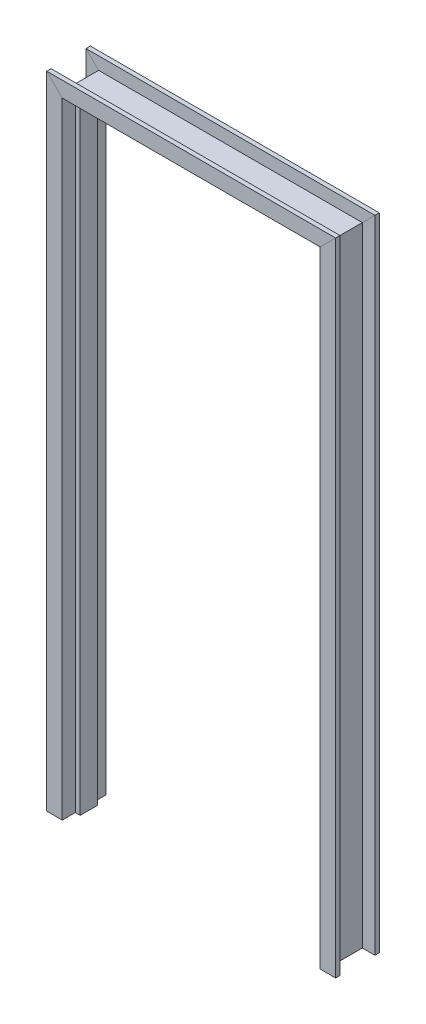
ISO-10303-21;
HEADER;
FILE_DESCRIPTION(('STEP AP214'),'2;1');
FILE_NAME('part.step','',(''),(''),'','','');
FILE_SCHEMA(('AUTOMOTIVE_DESIGN { 1 0 10303 214 1 1 1 1 }'));
ENDSEC;
DATA;
#1=APPLICATION_CONTEXT('core data for automotive mechanical design processes');
#2=APPLICATION_PROTOCOL_DEFINITION('international standard','automotive_design',2000,#1);
#3=PRODUCT_CONTEXT('',#1,'mechanical');
#4=PRODUCT('Part','Part','',(#3));
#5=PRODUCT_RELATED_PRODUCT_CATEGORY('part','',(#4));
#6=PRODUCT_DEFINITION_FORMATION('','',#4);
#7=PRODUCT_DEFINITION_CONTEXT('part definition',#1,'design');
#8=PRODUCT_DEFINITION('design','',#6,#7);
#9=PRODUCT_DEFINITION_SHAPE('','',#8);
#10=(LENGTH_UNIT() NAMED_UNIT(*) SI_UNIT(.MILLI.,.METRE.));
#11=(NAMED_UNIT(*) PLANE_ANGLE_UNIT() SI_UNIT($,.RADIAN.));
#12=(NAMED_UNIT(*) SI_UNIT($,.STERADIAN.) SOLID_ANGLE_UNIT());
#13=UNCERTAINTY_MEASURE_WITH_UNIT(LENGTH_MEASURE(1.E-05),#10,'distance_accuracy_value','');
#14=(GEOMETRIC_REPRESENTATION_CONTEXT(3) GLOBAL_UNCERTAINTY_ASSIGNED_CONTEXT((#13)) GLOBAL_UNIT_ASSIGNED_CONTEXT((#10,
#11,#12)) REPRESENTATION_CONTEXT('',''));
#15=CARTESIAN_POINT('',(0.,0.,0.));
#16=DIRECTION('',(0.,0.,1.));
#17=DIRECTION('',(1.,0.,0.));
#18=AXIS2_PLACEMENT_3D('',#15,#16,#17);
#19=CARTESIAN_POINT('',(812.799999999999,-4.44089209850063E-13,0.));
#20=DIRECTION('',(0.,-1.,0.));
#21=DIRECTION('',(0.,0.,1.));
#22=AXIS2_PLACEMENT_3D('',#19,#20,#21);
#23=PLANE('',#22);
#24=DIRECTION('',(-1.,0.,0.));
#25=VECTOR('',#24,1.);
#26=CARTESIAN_POINT('',(828.674999999999,-4.42145083056416E-13,0.));
#27=LINE('',#26,#25);
#28=CARTESIAN_POINT('',(828.674999999999,-4.43117146453239E-13,0.));
#29=VERTEX_POINT('',#28);
#30=CARTESIAN_POINT('',(812.799999999999,-4.44089209850063E-13,0.));
#31=VERTEX_POINT('',#30);
#32=EDGE_CURVE('E130',#29,#31,#27,.T.);
#33=ORIENTED_EDGE('',*,*,#32,.T.);
#34=DIRECTION('',(0.,0.,-1.));
#35=VECTOR('',#34,1.);
#36=CARTESIAN_POINT('',(812.799999999999,-4.44089209850063E-13,0.));
#37=LINE('',#36,#35);
#38=CARTESIAN_POINT('',(812.799999999999,-4.44089209850063E-13,-57.15));
#39=VERTEX_POINT('',#38);
#40=EDGE_CURVE('E149',#31,#39,#37,.T.);
#41=ORIENTED_EDGE('',*,*,#40,.T.);
#42=DIRECTION('',(1.,0.,0.));
#43=VECTOR('',#42,1.);
#44=CARTESIAN_POINT('',(812.799999999999,-4.44089209850063E-13,-57.15));
#45=LINE('',#44,#43);
#46=CARTESIAN_POINT('',(828.674999999999,-4.43117146453239E-13,-57.15));
#47=VERTEX_POINT('',#46);
#48=EDGE_CURVE('E188',#39,#47,#45,.T.);
#49=ORIENTED_EDGE('',*,*,#48,.T.);
#50=DIRECTION('',(0.,0.,-1.));
#51=VECTOR('',#50,1.);
#52=CARTESIAN_POINT('',(828.674999999999,-4.42145083056416E-13,-57.15));
#53=LINE('',#52,#51);
#54=CARTESIAN_POINT('',(828.674999999999,-4.43117146453239E-13,-100.0125));
#55=VERTEX_POINT('',#54);
#56=EDGE_CURVE('E190',#47,#55,#53,.T.);
#57=ORIENTED_EDGE('',*,*,#56,.T.);
#58=DIRECTION('',(1.,0.,0.));
#59=VECTOR('',#58,1.);
#60=CARTESIAN_POINT('',(828.674999999999,-4.42145083056416E-13,-100.0125));
#61=LINE('',#60,#59);
#62=CARTESIAN_POINT('',(879.475,-4.40006543583405E-13,-100.0125));
#63=VERTEX_POINT('',#62);
#64=EDGE_CURVE('E192',#55,#63,#61,.T.);
#65=ORIENTED_EDGE('',*,*,#64,.T.);
#66=DIRECTION('',(0.,0.,1.));
#67=VECTOR('',#66,1.);
#68=CARTESIAN_POINT('',(879.475,-4.35923877316748E-13,-100.0125));
#69=LINE('',#68,#67);
#70=CARTESIAN_POINT('',(879.475,-4.40006543583405E-13,-85.725));
#71=VERTEX_POINT('',#70);
#72=EDGE_CURVE('E194',#63,#71,#69,.T.);
#73=ORIENTED_EDGE('',*,*,#72,.T.);
#74=DIRECTION('',(-1.,0.,0.));
#75=VECTOR('',#74,1.);
#76=CARTESIAN_POINT('',(879.475,-4.35923877316748E-13,-85.725));
#77=LINE('',#76,#75);
#78=CARTESIAN_POINT('',(838.199999999999,-4.42533908415146E-13,-85.725));
#79=VERTEX_POINT('',#78);
#80=EDGE_CURVE('E196',#71,#79,#77,.T.);
#81=ORIENTED_EDGE('',*,*,#80,.T.);
#82=DIRECTION('',(0.,0.,1.));
#83=VECTOR('',#82,1.);
#84=CARTESIAN_POINT('',(838.199999999999,-4.40978606980228E-13,-85.725));
#85=LINE('',#84,#83);
#86=CARTESIAN_POINT('',(838.199999999999,-4.42533908415146E-13,28.575));
#87=VERTEX_POINT('',#86);
#88=EDGE_CURVE('E198',#79,#87,#85,.T.);
#89=ORIENTED_EDGE('',*,*,#88,.T.);
#90=DIRECTION('',(1.,0.,0.));
#91=VECTOR('',#90,1.);
#92=CARTESIAN_POINT('',(838.199999999999,-4.40978606980228E-13,28.575));
#93=LINE('',#92,#91);
#94=CARTESIAN_POINT('',(879.475,-4.40006543583405E-13,28.575));
#95=VERTEX_POINT('',#94);
#96=EDGE_CURVE('E200',#87,#95,#93,.T.);
#97=ORIENTED_EDGE('',*,*,#96,.T.);
#98=DIRECTION('',(0.,0.,1.));
#99=VECTOR('',#98,1.);
#100=CARTESIAN_POINT('',(879.475,-4.35923877316748E-13,28.575));
#101=LINE('',#100,#99);
#102=CARTESIAN_POINT('',(879.475,-4.40006543583405E-13,42.8625));
#103=VERTEX_POINT('',#102);
#104=EDGE_CURVE('E202',#95,#103,#101,.T.);
#105=ORIENTED_EDGE('',*,*,#104,.T.);
#106=DIRECTION('',(-1.,0.,0.));
#107=VECTOR('',#106,1.);
#108=CARTESIAN_POINT('',(879.475,-4.35923877316748E-13,42.8625));
#109=LINE('',#108,#107);
#110=CARTESIAN_POINT('',(828.674999999999,-4.43117146453239E-13,42.8625));
#111=VERTEX_POINT('',#110);
#112=EDGE_CURVE('E135',#103,#111,#109,.T.);
#113=ORIENTED_EDGE('',*,*,#112,.T.);
#114=DIRECTION('',(0.,0.,-1.));
#115=VECTOR('',#114,1.);
#116=CARTESIAN_POINT('',(828.674999999999,-4.42145083056416E-13,42.8625));
#117=LINE('',#116,#115);
#118=EDGE_CURVE('E133',#111,#29,#117,.T.);
#119=ORIENTED_EDGE('',*,*,#118,.T.);
#120=EDGE_LOOP('',(#33,#41,#49,#57,#65,#73,#81,#89,#97,#105,#113,#119));
#121=FACE_BOUND('',#120,.T.);
#122=ADVANCED_FACE('F36',(#121),#23,.T.);
#123=CARTESIAN_POINT('',(0.,0.,0.));
#124=DIRECTION('',(0.,1.,0.));
#125=DIRECTION('',(0.,0.,1.));
#126=AXIS2_PLACEMENT_3D('',#123,#124,#125);
#127=PLANE('',#126);
#128=DIRECTION('',(1.,0.,0.));
#129=VECTOR('',#128,1.);
#130=CARTESIAN_POINT('',(-15.875,0.,0.));
#131=LINE('',#130,#129);
#132=CARTESIAN_POINT('',(-15.875,0.,0.));
#133=VERTEX_POINT('',#132);
#134=CARTESIAN_POINT('',(0.,0.,0.));
#135=VERTEX_POINT('',#134);
#136=EDGE_CURVE('E269',#133,#135,#131,.T.);
#137=ORIENTED_EDGE('',*,*,#136,.F.);
#138=DIRECTION('',(0.,0.,-1.));
#139=VECTOR('',#138,1.);
#140=CARTESIAN_POINT('',(-15.875,0.,42.8625));
#141=LINE('',#140,#139);
#142=CARTESIAN_POINT('',(-15.875,0.,42.8625));
#143=VERTEX_POINT('',#142);
#144=EDGE_CURVE('E275',#143,#133,#141,.T.);
#145=ORIENTED_EDGE('',*,*,#144,.F.);
#146=DIRECTION('',(1.,0.,0.));
#147=VECTOR('',#146,1.);
#148=CARTESIAN_POINT('',(-66.675,0.,42.8625));
#149=LINE('',#148,#147);
#150=CARTESIAN_POINT('',(-66.675,0.,42.8625));
#151=VERTEX_POINT('',#150);
#152=EDGE_CURVE('E279',#151,#143,#149,.T.);
#153=ORIENTED_EDGE('',*,*,#152,.F.);
#154=DIRECTION('',(0.,0.,1.));
#155=VECTOR('',#154,1.);
#156=CARTESIAN_POINT('',(-66.675,0.,28.575));
#157=LINE('',#156,#155);
#158=CARTESIAN_POINT('',(-66.675,0.,28.575));
#159=VERTEX_POINT('',#158);
#160=EDGE_CURVE('E285',#159,#151,#157,.T.);
#161=ORIENTED_EDGE('',*,*,#160,.F.);
#162=DIRECTION('',(-1.,0.,0.));
#163=VECTOR('',#162,1.);
#164=CARTESIAN_POINT('',(-25.4,0.,28.575));
#165=LINE('',#164,#163);
#166=CARTESIAN_POINT('',(-25.4,0.,28.575));
#167=VERTEX_POINT('',#166);
#168=EDGE_CURVE('E291',#167,#159,#165,.T.);
#169=ORIENTED_EDGE('',*,*,#168,.F.);
#170=DIRECTION('',(0.,0.,1.));
#171=VECTOR('',#170,1.);
#172=CARTESIAN_POINT('',(-25.4,0.,-85.725));
#173=LINE('',#172,#171);
#174=CARTESIAN_POINT('',(-25.4,0.,-85.725));
#175=VERTEX_POINT('',#174);
#176=EDGE_CURVE('E297',#175,#167,#173,.T.);
#177=ORIENTED_EDGE('',*,*,#176,.F.);
#178=DIRECTION('',(1.,0.,0.));
#179=VECTOR('',#178,1.);
#180=CARTESIAN_POINT('',(-66.675,0.,-85.725));
#181=LINE('',#180,#179);
#182=CARTESIAN_POINT('',(-66.675,0.,-85.725));
#183=VERTEX_POINT('',#182);
#184=EDGE_CURVE('E303',#183,#175,#181,.T.);
#185=ORIENTED_EDGE('',*,*,#184,.F.);
#186=DIRECTION('',(0.,0.,1.));
#187=VECTOR('',#186,1.);
#188=CARTESIAN_POINT('',(-66.675,0.,-100.0125));
#189=LINE('',#188,#187);
#190=CARTESIAN_POINT('',(-66.675,0.,-100.0125));
#191=VERTEX_POINT('',#190);
#192=EDGE_CURVE('E309',#191,#183,#189,.T.);
#193=ORIENTED_EDGE('',*,*,#192,.F.);
#194=DIRECTION('',(-1.,0.,0.));
#195=VECTOR('',#194,1.);
#196=CARTESIAN_POINT('',(-15.875,0.,-100.0125));
#197=LINE('',#196,#195);
#198=CARTESIAN_POINT('',(-15.875,0.,-100.0125));
#199=VERTEX_POINT('',#198);
#200=EDGE_CURVE('E315',#199,#191,#197,.T.);
#201=ORIENTED_EDGE('',*,*,#200,.F.);
#202=DIRECTION('',(0.,0.,-1.));
#203=VECTOR('',#202,1.);
#204=CARTESIAN_POINT('',(-15.875,0.,-57.15));
#205=LINE('',#204,#203);
#206=CARTESIAN_POINT('',(-15.875,0.,-57.15));
#207=VERTEX_POINT('',#206);
#208=EDGE_CURVE('E321',#207,#199,#205,.T.);
#209=ORIENTED_EDGE('',*,*,#208,.F.);
#210=DIRECTION('',(-1.,0.,0.));
#211=VECTOR('',#210,1.);
#212=CARTESIAN_POINT('',(0.,0.,-57.15));
#213=LINE('',#212,#211);
#214=CARTESIAN_POINT('',(0.,0.,-57.15));
#215=VERTEX_POINT('',#214);
#216=EDGE_CURVE('E327',#215,#207,#213,.T.);
#217=ORIENTED_EDGE('',*,*,#216,.F.);
#218=DIRECTION('',(0.,0.,-1.));
#219=VECTOR('',#218,1.);
#220=CARTESIAN_POINT('',(0.,0.,0.));
#221=LINE('',#220,#219);
#222=EDGE_CURVE('E333',#135,#215,#221,.T.);
#223=ORIENTED_EDGE('',*,*,#222,.F.);
#224=EDGE_LOOP('',(#137,#145,#153,#161,#169,#177,#185,#193,#201,#209,#217,#223));
#225=FACE_BOUND('',#224,.T.);
#226=ADVANCED_FACE('F390',(#225),#127,.F.);
#227=CARTESIAN_POINT('',(828.674999999999,2105.4425,0.));
#228=DIRECTION('',(0.,0.,1.));
#229=DIRECTION('',(1.,0.,0.));
#230=AXIS2_PLACEMENT_3D('',#227,#228,#229);
#231=PLANE('',#230);
#232=DIRECTION('',(0.707106781186548,0.707106781186548,0.));
#233=VECTOR('',#232,1.);
#234=CARTESIAN_POINT('',(377.61625,1596.81625,0.));
#235=LINE('',#234,#233);
#236=CARTESIAN_POINT('',(812.799999999999,2032.,0.));
#237=VERTEX_POINT('',#236);
#238=CARTESIAN_POINT('',(828.674999999999,2047.875,0.));
#239=VERTEX_POINT('',#238);
#240=EDGE_CURVE('E205',#237,#239,#235,.T.);
#241=ORIENTED_EDGE('',*,*,#240,.F.);
#242=DIRECTION('',(0.,-1.,0.));
#243=VECTOR('',#242,1.);
#244=CARTESIAN_POINT('',(812.799999999999,2105.4425,0.));
#245=LINE('',#244,#243);
#246=EDGE_CURVE('E147',#237,#31,#245,.T.);
#247=ORIENTED_EDGE('',*,*,#246,.T.);
#248=ORIENTED_EDGE('',*,*,#32,.F.);
#249=DIRECTION('',(0.,-1.,0.));
#250=VECTOR('',#249,1.);
#251=CARTESIAN_POINT('',(828.674999999999,2105.4425,0.));
#252=LINE('',#251,#250);
#253=EDGE_CURVE('E39',#239,#29,#252,.T.);
#254=ORIENTED_EDGE('',*,*,#253,.F.);
#255=EDGE_LOOP('',(#241,#247,#248,#254));
#256=FACE_BOUND('',#255,.T.);
#257=ADVANCED_FACE('F144',(#256),#231,.T.);
#258=CARTESIAN_POINT('',(812.799999999999,2105.4425,0.));
#259=DIRECTION('',(-1.,0.,0.));
#260=DIRECTION('',(0.,-1.,0.));
#261=AXIS2_PLACEMENT_3D('',#258,#259,#260);
#262=PLANE('',#261);
#263=DIRECTION('',(0.,0.,1.));
#264=VECTOR('',#263,1.);
#265=CARTESIAN_POINT('',(812.799999999999,2032.,0.));
#266=LINE('',#265,#264);
#267=CARTESIAN_POINT('',(812.799999999999,2032.,-57.15));
#268=VERTEX_POINT('',#267);
#269=EDGE_CURVE('E266',#268,#237,#266,.T.);
#270=ORIENTED_EDGE('',*,*,#269,.F.);
#271=DIRECTION('',(0.,-1.,0.));
#272=VECTOR('',#271,1.);
#273=CARTESIAN_POINT('',(812.799999999999,2105.4425,-57.15));
#274=LINE('',#273,#272);
#275=EDGE_CURVE('E158',#268,#39,#274,.T.);
#276=ORIENTED_EDGE('',*,*,#275,.T.);
#277=ORIENTED_EDGE('',*,*,#40,.F.);
#278=ORIENTED_EDGE('',*,*,#246,.F.);
#279=EDGE_LOOP('',(#270,#276,#277,#278));
#280=FACE_BOUND('',#279,.T.);
#281=ADVANCED_FACE('F524',(#280),#262,.T.);
#282=CARTESIAN_POINT('',(812.799999999999,2105.4425,-57.15));
#283=DIRECTION('',(0.,0.,-1.));
#284=DIRECTION('',(-1.,0.,0.));
#285=AXIS2_PLACEMENT_3D('',#282,#283,#284);
#286=PLANE('',#285);
#287=DIRECTION('',(-0.707106781186548,-0.707106781186548,0.));
#288=VECTOR('',#287,1.);
#289=CARTESIAN_POINT('',(369.67875,1588.87875,-57.15));
#290=LINE('',#289,#288);
#291=CARTESIAN_POINT('',(828.674999999999,2047.875,-57.15));
#292=VERTEX_POINT('',#291);
#293=EDGE_CURVE('E263',#292,#268,#290,.T.);
#294=ORIENTED_EDGE('',*,*,#293,.F.);
#295=DIRECTION('',(0.,-1.,0.));
#296=VECTOR('',#295,1.);
#297=CARTESIAN_POINT('',(828.674999999999,2105.4425,-57.15));
#298=LINE('',#297,#296);
#299=EDGE_CURVE('E160',#292,#47,#298,.T.);
#300=ORIENTED_EDGE('',*,*,#299,.T.);
#301=ORIENTED_EDGE('',*,*,#48,.F.);
#302=ORIENTED_EDGE('',*,*,#275,.F.);
#303=EDGE_LOOP('',(#294,#300,#301,#302));
#304=FACE_BOUND('',#303,.T.);
#305=ADVANCED_FACE('F530',(#304),#286,.T.);
#306=CARTESIAN_POINT('',(828.674999999999,2105.4425,-57.15));
#307=DIRECTION('',(-1.,0.,0.));
#308=DIRECTION('',(0.,-1.,0.));
#309=AXIS2_PLACEMENT_3D('',#306,#307,#308);
#310=PLANE('',#309);
#311=DIRECTION('',(0.,0.,1.));
#312=VECTOR('',#311,1.);
#313=CARTESIAN_POINT('',(828.674999999999,2047.875,-57.15));
#314=LINE('',#313,#312);
#315=CARTESIAN_POINT('',(828.674999999999,2047.875,-100.0125));
#316=VERTEX_POINT('',#315);
#317=EDGE_CURVE('E260',#316,#292,#314,.T.);
#318=ORIENTED_EDGE('',*,*,#317,.F.);
#319=DIRECTION('',(0.,-1.,0.));
#320=VECTOR('',#319,1.);
#321=CARTESIAN_POINT('',(828.674999999999,2105.4425,-100.0125));
#322=LINE('',#321,#320);
#323=EDGE_CURVE('E165',#316,#55,#322,.T.);
#324=ORIENTED_EDGE('',*,*,#323,.T.);
#325=ORIENTED_EDGE('',*,*,#56,.F.);
#326=ORIENTED_EDGE('',*,*,#299,.F.);
#327=EDGE_LOOP('',(#318,#324,#325,#326));
#328=FACE_BOUND('',#327,.T.);
#329=ADVANCED_FACE('F534',(#328),#310,.T.);
#330=CARTESIAN_POINT('',(828.674999999999,2105.4425,-100.0125));
#331=DIRECTION('',(0.,0.,-1.));
#332=DIRECTION('',(-1.,0.,0.));
#333=AXIS2_PLACEMENT_3D('',#330,#331,#332);
#334=PLANE('',#333);
#335=DIRECTION('',(-0.707106781186548,-0.707106781186548,0.));
#336=VECTOR('',#335,1.);
#337=CARTESIAN_POINT('',(377.61625,1596.81625,-100.0125));
#338=LINE('',#337,#336);
#339=CARTESIAN_POINT('',(879.474999999999,2098.675,-100.0125));
#340=VERTEX_POINT('',#339);
#341=EDGE_CURVE('E257',#340,#316,#338,.T.);
#342=ORIENTED_EDGE('',*,*,#341,.F.);
#343=DIRECTION('',(0.,-1.,0.));
#344=VECTOR('',#343,1.);
#345=CARTESIAN_POINT('',(879.474999999999,2105.4425,-100.0125));
#346=LINE('',#345,#344);
#347=EDGE_CURVE('E168',#340,#63,#346,.T.);
#348=ORIENTED_EDGE('',*,*,#347,.T.);
#349=ORIENTED_EDGE('',*,*,#64,.F.);
#350=ORIENTED_EDGE('',*,*,#323,.F.);
#351=EDGE_LOOP('',(#342,#348,#349,#350));
#352=FACE_BOUND('',#351,.T.);
#353=ADVANCED_FACE('F539',(#352),#334,.T.);
#354=CARTESIAN_POINT('',(879.474999999999,2105.4425,-100.0125));
#355=DIRECTION('',(1.,0.,0.));
#356=DIRECTION('',(0.,1.,0.));
#357=AXIS2_PLACEMENT_3D('',#354,#355,#356);
#358=PLANE('',#357);
#359=DIRECTION('',(0.,0.,-1.));
#360=VECTOR('',#359,1.);
#361=CARTESIAN_POINT('',(879.474999999999,2098.675,-100.0125));
#362=LINE('',#361,#360);
#363=CARTESIAN_POINT('',(879.474999999999,2098.675,-85.725));
#364=VERTEX_POINT('',#363);
#365=EDGE_CURVE('E254',#364,#340,#362,.T.);
#366=ORIENTED_EDGE('',*,*,#365,.F.);
#367=DIRECTION('',(0.,-1.,0.));
#368=VECTOR('',#367,1.);
#369=CARTESIAN_POINT('',(879.474999999999,2105.4425,-85.725));
#370=LINE('',#369,#368);
#371=EDGE_CURVE('E171',#364,#71,#370,.T.);
#372=ORIENTED_EDGE('',*,*,#371,.T.);
#373=ORIENTED_EDGE('',*,*,#72,.F.);
#374=ORIENTED_EDGE('',*,*,#347,.F.);
#375=EDGE_LOOP('',(#366,#372,#373,#374));
#376=FACE_BOUND('',#375,.T.);
#377=ADVANCED_FACE('F542',(#376),#358,.T.);
#378=CARTESIAN_POINT('',(879.474999999999,2105.4425,-85.725));
#379=DIRECTION('',(0.,0.,1.));
#380=DIRECTION('',(1.,0.,0.));
#381=AXIS2_PLACEMENT_3D('',#378,#379,#380);
#382=PLANE('',#381);
#383=DIRECTION('',(0.707106781186548,0.707106781186548,0.));
#384=VECTOR('',#383,1.);
#385=CARTESIAN_POINT('',(403.01625,1622.21625,-85.725));
#386=LINE('',#385,#384);
#387=CARTESIAN_POINT('',(838.199999999999,2057.4,-85.725));
#388=VERTEX_POINT('',#387);
#389=EDGE_CURVE('E251',#388,#364,#386,.T.);
#390=ORIENTED_EDGE('',*,*,#389,.F.);
#391=DIRECTION('',(0.,-1.,0.));
#392=VECTOR('',#391,1.);
#393=CARTESIAN_POINT('',(838.199999999999,2105.4425,-85.725));
#394=LINE('',#393,#392);
#395=EDGE_CURVE('E174',#388,#79,#394,.T.);
#396=ORIENTED_EDGE('',*,*,#395,.T.);
#397=ORIENTED_EDGE('',*,*,#80,.F.);
#398=ORIENTED_EDGE('',*,*,#371,.F.);
#399=EDGE_LOOP('',(#390,#396,#397,#398));
#400=FACE_BOUND('',#399,.T.);
#401=ADVANCED_FACE('F493',(#400),#382,.T.);
#402=CARTESIAN_POINT('',(838.199999999999,2105.4425,-85.725));
#403=DIRECTION('',(1.,0.,0.));
#404=DIRECTION('',(0.,0.,-1.));
#405=AXIS2_PLACEMENT_3D('',#402,#403,#404);
#406=PLANE('',#405);
#407=DIRECTION('',(0.,0.,-1.));
#408=VECTOR('',#407,1.);
#409=CARTESIAN_POINT('',(838.199999999999,2057.4,-85.7249999999999));
#410=LINE('',#409,#408);
#411=CARTESIAN_POINT('',(838.199999999999,2057.4,28.575));
#412=VERTEX_POINT('',#411);
#413=EDGE_CURVE('E248',#412,#388,#410,.T.);
#414=ORIENTED_EDGE('',*,*,#413,.F.);
#415=DIRECTION('',(0.,-1.,0.));
#416=VECTOR('',#415,1.);
#417=CARTESIAN_POINT('',(838.199999999999,2105.4425,28.575));
#418=LINE('',#417,#416);
#419=EDGE_CURVE('E177',#412,#87,#418,.T.);
#420=ORIENTED_EDGE('',*,*,#419,.T.);
#421=ORIENTED_EDGE('',*,*,#88,.F.);
#422=ORIENTED_EDGE('',*,*,#395,.F.);
#423=EDGE_LOOP('',(#414,#420,#421,#422));
#424=FACE_BOUND('',#423,.T.);
#425=ADVANCED_FACE('F497',(#424),#406,.T.);
#426=CARTESIAN_POINT('',(838.199999999999,2105.4425,28.575));
#427=DIRECTION('',(0.,0.,-1.));
#428=DIRECTION('',(-1.,0.,0.));
#429=AXIS2_PLACEMENT_3D('',#426,#427,#428);
#430=PLANE('',#429);
#431=DIRECTION('',(-0.707106781186548,-0.707106781186548,0.));
#432=VECTOR('',#431,1.);
#433=CARTESIAN_POINT('',(382.37875,1601.57875,28.575));
#434=LINE('',#433,#432);
#435=CARTESIAN_POINT('',(879.474999999999,2098.675,28.575));
#436=VERTEX_POINT('',#435);
#437=EDGE_CURVE('E245',#436,#412,#434,.T.);
#438=ORIENTED_EDGE('',*,*,#437,.F.);
#439=DIRECTION('',(0.,-1.,0.));
#440=VECTOR('',#439,1.);
#441=CARTESIAN_POINT('',(879.474999999999,2105.4425,28.575));
#442=LINE('',#441,#440);
#443=EDGE_CURVE('E180',#436,#95,#442,.T.);
#444=ORIENTED_EDGE('',*,*,#443,.T.);
#445=ORIENTED_EDGE('',*,*,#96,.F.);
#446=ORIENTED_EDGE('',*,*,#419,.F.);
#447=EDGE_LOOP('',(#438,#444,#445,#446));
#448=FACE_BOUND('',#447,.T.);
#449=ADVANCED_FACE('F507',(#448),#430,.T.);
#450=CARTESIAN_POINT('',(879.474999999999,2105.4425,28.575));
#451=DIRECTION('',(1.,0.,0.));
#452=DIRECTION('',(0.,1.,0.));
#453=AXIS2_PLACEMENT_3D('',#450,#451,#452);
#454=PLANE('',#453);
#455=DIRECTION('',(0.,0.,-1.));
#456=VECTOR('',#455,1.);
#457=CARTESIAN_POINT('',(879.474999999999,2098.675,28.575));
#458=LINE('',#457,#456);
#459=CARTESIAN_POINT('',(879.474999999999,2098.675,42.8625));
#460=VERTEX_POINT('',#459);
#461=EDGE_CURVE('E242',#460,#436,#458,.T.);
#462=ORIENTED_EDGE('',*,*,#461,.F.);
#463=DIRECTION('',(0.,-1.,0.));
#464=VECTOR('',#463,1.);
#465=CARTESIAN_POINT('',(879.474999999999,2105.4425,42.8625));
#466=LINE('',#465,#464);
#467=EDGE_CURVE('E183',#460,#103,#466,.T.);
#468=ORIENTED_EDGE('',*,*,#467,.T.);
#469=ORIENTED_EDGE('',*,*,#104,.F.);
#470=ORIENTED_EDGE('',*,*,#443,.F.);
#471=EDGE_LOOP('',(#462,#468,#469,#470));
#472=FACE_BOUND('',#471,.T.);
#473=ADVANCED_FACE('F511',(#472),#454,.T.);
#474=CARTESIAN_POINT('',(879.474999999999,2105.4425,42.8625));
#475=DIRECTION('',(0.,0.,1.));
#476=DIRECTION('',(1.,0.,0.));
#477=AXIS2_PLACEMENT_3D('',#474,#475,#476);
#478=PLANE('',#477);
#479=DIRECTION('',(0.707106781186548,0.707106781186548,0.));
#480=VECTOR('',#479,1.);
#481=CARTESIAN_POINT('',(403.01625,1622.21625,42.8625000000001));
#482=LINE('',#481,#480);
#483=CARTESIAN_POINT('',(828.674999999999,2047.875,42.8625));
#484=VERTEX_POINT('',#483);
#485=EDGE_CURVE('E239',#484,#460,#482,.T.);
#486=ORIENTED_EDGE('',*,*,#485,.F.);
#487=DIRECTION('',(0.,-1.,0.));
#488=VECTOR('',#487,1.);
#489=CARTESIAN_POINT('',(828.674999999999,2105.4425,42.8625));
#490=LINE('',#489,#488);
#491=EDGE_CURVE('E148',#484,#111,#490,.T.);
#492=ORIENTED_EDGE('',*,*,#491,.T.);
#493=ORIENTED_EDGE('',*,*,#112,.F.);
#494=ORIENTED_EDGE('',*,*,#467,.F.);
#495=EDGE_LOOP('',(#486,#492,#493,#494));
#496=FACE_BOUND('',#495,.T.);
#497=ADVANCED_FACE('F519',(#496),#478,.T.);
#498=CARTESIAN_POINT('',(828.674999999999,2105.4425,42.8625));
#499=DIRECTION('',(-1.,0.,0.));
#500=DIRECTION('',(0.,-1.,0.));
#501=AXIS2_PLACEMENT_3D('',#498,#499,#500);
#502=PLANE('',#501);
#503=DIRECTION('',(0.,0.,1.));
#504=VECTOR('',#503,1.);
#505=CARTESIAN_POINT('',(828.674999999999,2047.875,42.8625));
#506=LINE('',#505,#504);
#507=EDGE_CURVE('E153',#239,#484,#506,.T.);
#508=ORIENTED_EDGE('',*,*,#507,.F.);
#509=ORIENTED_EDGE('',*,*,#253,.T.);
#510=ORIENTED_EDGE('',*,*,#118,.F.);
#511=ORIENTED_EDGE('',*,*,#491,.F.);
#512=EDGE_LOOP('',(#508,#509,#510,#511));
#513=FACE_BOUND('',#512,.T.);
#514=ADVANCED_FACE('F151',(#513),#502,.T.);
#515=CARTESIAN_POINT('',(-73.4424999999996,2047.875,42.8625));
#516=DIRECTION('',(0.,-1.,0.));
#517=DIRECTION('',(0.,0.,-1.));
#518=AXIS2_PLACEMENT_3D('',#515,#516,#517);
#519=PLANE('',#518);
#520=DIRECTION('',(1.,0.,0.));
#521=VECTOR('',#520,1.);
#522=CARTESIAN_POINT('',(-73.4424999999996,2047.875,0.));
#523=LINE('',#522,#521);
#524=CARTESIAN_POINT('',(-15.8749999999997,2047.875,0.));
#525=VERTEX_POINT('',#524);
#526=EDGE_CURVE('E207',#525,#239,#523,.T.);
#527=ORIENTED_EDGE('',*,*,#526,.T.);
#528=ORIENTED_EDGE('',*,*,#507,.T.);
#529=DIRECTION('',(1.,0.,0.));
#530=VECTOR('',#529,1.);
#531=CARTESIAN_POINT('',(-73.4424999999996,2047.875,42.8625));
#532=LINE('',#531,#530);
#533=CARTESIAN_POINT('',(-15.8749999999998,2047.875,42.8625));
#534=VERTEX_POINT('',#533);
#535=EDGE_CURVE('E154',#534,#484,#532,.T.);
#536=ORIENTED_EDGE('',*,*,#535,.F.);
#537=DIRECTION('',(0.,0.,1.));
#538=VECTOR('',#537,1.);
#539=CARTESIAN_POINT('',(-15.875,2047.875,42.8625));
#540=LINE('',#539,#538);
#541=EDGE_CURVE('E273',#525,#534,#540,.T.);
#542=ORIENTED_EDGE('',*,*,#541,.F.);
#543=EDGE_LOOP('',(#527,#528,#536,#542));
#544=FACE_BOUND('',#543,.T.);
#545=ADVANCED_FACE('F520',(#544),#519,.T.);
#546=CARTESIAN_POINT('',(-73.4424999999996,2098.675,42.8625));
#547=DIRECTION('',(0.,0.,1.));
#548=DIRECTION('',(0.,-1.,0.));
#549=AXIS2_PLACEMENT_3D('',#546,#547,#548);
#550=PLANE('',#549);
#551=ORIENTED_EDGE('',*,*,#535,.T.);
#552=ORIENTED_EDGE('',*,*,#485,.T.);
#553=DIRECTION('',(1.,0.,0.));
#554=VECTOR('',#553,1.);
#555=CARTESIAN_POINT('',(-73.4424999999996,2098.675,42.8625));
#556=LINE('',#555,#554);
#557=CARTESIAN_POINT('',(-66.6749999999998,2098.675,42.8625));
#558=VERTEX_POINT('',#557);
#559=EDGE_CURVE('E156',#558,#460,#556,.T.);
#560=ORIENTED_EDGE('',*,*,#559,.F.);
#561=DIRECTION('',(-0.707106781186548,0.707106781186548,0.));
#562=VECTOR('',#561,1.);
#563=CARTESIAN_POINT('',(982.6625,1049.3375,42.8625000000001));
#564=LINE('',#563,#562);
#565=EDGE_CURVE('E347',#534,#558,#564,.T.);
#566=ORIENTED_EDGE('',*,*,#565,.F.);
#567=EDGE_LOOP('',(#551,#552,#560,#566));
#568=FACE_BOUND('',#567,.T.);
#569=ADVANCED_FACE('F517',(#568),#550,.T.);
#570=CARTESIAN_POINT('',(-73.4424999999996,2098.675,28.575));
#571=DIRECTION('',(0.,1.,0.));
#572=DIRECTION('',(0.,0.,1.));
#573=AXIS2_PLACEMENT_3D('',#570,#571,#572);
#574=PLANE('',#573);
#575=ORIENTED_EDGE('',*,*,#559,.T.);
#576=ORIENTED_EDGE('',*,*,#461,.T.);
#577=DIRECTION('',(1.,0.,0.));
#578=VECTOR('',#577,1.);
#579=CARTESIAN_POINT('',(-73.4424999999996,2098.675,28.575));
#580=LINE('',#579,#578);
#581=CARTESIAN_POINT('',(-66.6749999999998,2098.675,28.575));
#582=VERTEX_POINT('',#581);
#583=EDGE_CURVE('E233',#582,#436,#580,.T.);
#584=ORIENTED_EDGE('',*,*,#583,.F.);
#585=DIRECTION('',(0.,0.,-1.));
#586=VECTOR('',#585,1.);
#587=CARTESIAN_POINT('',(-66.675,2098.675,28.575));
#588=LINE('',#587,#586);
#589=EDGE_CURVE('E350',#558,#582,#588,.T.);
#590=ORIENTED_EDGE('',*,*,#589,.F.);
#591=EDGE_LOOP('',(#575,#576,#584,#590));
#592=FACE_BOUND('',#591,.T.);
#593=ADVANCED_FACE('F514',(#592),#574,.T.);
#594=CARTESIAN_POINT('',(-73.4424999999996,2057.4,28.575));
#595=DIRECTION('',(0.,0.,-1.));
#596=DIRECTION('',(-1.,0.,0.));
#597=AXIS2_PLACEMENT_3D('',#594,#595,#596);
#598=PLANE('',#597);
#599=ORIENTED_EDGE('',*,*,#583,.T.);
#600=ORIENTED_EDGE('',*,*,#437,.T.);
#601=DIRECTION('',(1.,0.,0.));
#602=VECTOR('',#601,1.);
#603=CARTESIAN_POINT('',(-73.4424999999996,2057.4,28.575));
#604=LINE('',#603,#602);
#605=CARTESIAN_POINT('',(-25.3999999999997,2057.4,28.575));
#606=VERTEX_POINT('',#605);
#607=EDGE_CURVE('E230',#606,#412,#604,.T.);
#608=ORIENTED_EDGE('',*,*,#607,.F.);
#609=DIRECTION('',(0.707106781186548,-0.707106781186548,0.));
#610=VECTOR('',#609,1.);
#611=CARTESIAN_POINT('',(1003.3,1028.7,28.575));
#612=LINE('',#611,#610);
#613=EDGE_CURVE('E353',#582,#606,#612,.T.);
#614=ORIENTED_EDGE('',*,*,#613,.F.);
#615=EDGE_LOOP('',(#599,#600,#608,#614));
#616=FACE_BOUND('',#615,.T.);
#617=ADVANCED_FACE('F503',(#616),#598,.T.);
#618=CARTESIAN_POINT('',(-73.4424999999996,2057.4,-85.725));
#619=DIRECTION('',(0.,1.,0.));
#620=DIRECTION('',(0.,0.,1.));
#621=AXIS2_PLACEMENT_3D('',#618,#619,#620);
#622=PLANE('',#621);
#623=ORIENTED_EDGE('',*,*,#607,.T.);
#624=ORIENTED_EDGE('',*,*,#413,.T.);
#625=DIRECTION('',(1.,0.,0.));
#626=VECTOR('',#625,1.);
#627=CARTESIAN_POINT('',(-73.4424999999996,2057.4,-85.725));
#628=LINE('',#627,#626);
#629=CARTESIAN_POINT('',(-25.3999999999998,2057.4,-85.725));
#630=VERTEX_POINT('',#629);
#631=EDGE_CURVE('E227',#630,#388,#628,.T.);
#632=ORIENTED_EDGE('',*,*,#631,.F.);
#633=DIRECTION('',(0.,0.,-1.));
#634=VECTOR('',#633,1.);
#635=CARTESIAN_POINT('',(-25.4,2057.4,-85.7249999999998));
#636=LINE('',#635,#634);
#637=EDGE_CURVE('E356',#606,#630,#636,.T.);
#638=ORIENTED_EDGE('',*,*,#637,.F.);
#639=EDGE_LOOP('',(#623,#624,#632,#638));
#640=FACE_BOUND('',#639,.T.);
#641=ADVANCED_FACE('F500',(#640),#622,.T.);
#642=CARTESIAN_POINT('',(-73.4424999999996,2098.675,-85.725));
#643=DIRECTION('',(0.,0.,1.));
#644=DIRECTION('',(1.,0.,0.));
#645=AXIS2_PLACEMENT_3D('',#642,#643,#644);
#646=PLANE('',#645);
#647=ORIENTED_EDGE('',*,*,#631,.T.);
#648=ORIENTED_EDGE('',*,*,#389,.T.);
#649=DIRECTION('',(1.,0.,0.));
#650=VECTOR('',#649,1.);
#651=CARTESIAN_POINT('',(-73.4424999999996,2098.675,-85.725));
#652=LINE('',#651,#650);
#653=CARTESIAN_POINT('',(-66.6749999999998,2098.675,-85.725));
#654=VERTEX_POINT('',#653);
#655=EDGE_CURVE('E224',#654,#364,#652,.T.);
#656=ORIENTED_EDGE('',*,*,#655,.F.);
#657=DIRECTION('',(-0.707106781186548,0.707106781186548,0.));
#658=VECTOR('',#657,1.);
#659=CARTESIAN_POINT('',(982.6625,1049.3375,-85.725));
#660=LINE('',#659,#658);
#661=EDGE_CURVE('E359',#630,#654,#660,.T.);
#662=ORIENTED_EDGE('',*,*,#661,.F.);
#663=EDGE_LOOP('',(#647,#648,#656,#662));
#664=FACE_BOUND('',#663,.T.);
#665=ADVANCED_FACE('F488',(#664),#646,.T.);
#666=CARTESIAN_POINT('',(-73.4424999999996,2098.675,-100.0125));
#667=DIRECTION('',(0.,1.,0.));
#668=DIRECTION('',(0.,0.,1.));
#669=AXIS2_PLACEMENT_3D('',#666,#667,#668);
#670=PLANE('',#669);
#671=ORIENTED_EDGE('',*,*,#655,.T.);
#672=ORIENTED_EDGE('',*,*,#365,.T.);
#673=DIRECTION('',(1.,0.,0.));
#674=VECTOR('',#673,1.);
#675=CARTESIAN_POINT('',(-73.4424999999996,2098.675,-100.0125));
#676=LINE('',#675,#674);
#677=CARTESIAN_POINT('',(-66.6749999999998,2098.675,-100.0125));
#678=VERTEX_POINT('',#677);
#679=EDGE_CURVE('E221',#678,#340,#676,.T.);
#680=ORIENTED_EDGE('',*,*,#679,.F.);
#681=DIRECTION('',(0.,0.,-1.));
#682=VECTOR('',#681,1.);
#683=CARTESIAN_POINT('',(-66.675,2098.675,-100.0125));
#684=LINE('',#683,#682);
#685=EDGE_CURVE('E362',#654,#678,#684,.T.);
#686=ORIENTED_EDGE('',*,*,#685,.F.);
#687=EDGE_LOOP('',(#671,#672,#680,#686));
#688=FACE_BOUND('',#687,.T.);
#689=ADVANCED_FACE('F486',(#688),#670,.T.);
#690=CARTESIAN_POINT('',(-73.4424999999996,2047.875,-100.0125));
#691=DIRECTION('',(0.,0.,-1.));
#692=DIRECTION('',(0.,1.,0.));
#693=AXIS2_PLACEMENT_3D('',#690,#691,#692);
#694=PLANE('',#693);
#695=ORIENTED_EDGE('',*,*,#679,.T.);
#696=ORIENTED_EDGE('',*,*,#341,.T.);
#697=DIRECTION('',(1.,0.,0.));
#698=VECTOR('',#697,1.);
#699=CARTESIAN_POINT('',(-73.4424999999996,2047.875,-100.0125));
#700=LINE('',#699,#698);
#701=CARTESIAN_POINT('',(-15.8749999999997,2047.875,-100.0125));
#702=VERTEX_POINT('',#701);
#703=EDGE_CURVE('E218',#702,#316,#700,.T.);
#704=ORIENTED_EDGE('',*,*,#703,.F.);
#705=DIRECTION('',(0.707106781186548,-0.707106781186548,0.));
#706=VECTOR('',#705,1.);
#707=CARTESIAN_POINT('',(1008.0625,1023.9375,-100.0125));
#708=LINE('',#707,#706);
#709=EDGE_CURVE('E365',#678,#702,#708,.T.);
#710=ORIENTED_EDGE('',*,*,#709,.F.);
#711=EDGE_LOOP('',(#695,#696,#704,#710));
#712=FACE_BOUND('',#711,.T.);
#713=ADVANCED_FACE('F438',(#712),#694,.T.);
#714=CARTESIAN_POINT('',(-73.4424999999996,2047.875,-57.15));
#715=DIRECTION('',(0.,-1.,0.));
#716=DIRECTION('',(0.,0.,-1.));
#717=AXIS2_PLACEMENT_3D('',#714,#715,#716);
#718=PLANE('',#717);
#719=ORIENTED_EDGE('',*,*,#703,.T.);
#720=ORIENTED_EDGE('',*,*,#317,.T.);
#721=DIRECTION('',(1.,0.,0.));
#722=VECTOR('',#721,1.);
#723=CARTESIAN_POINT('',(-73.4424999999996,2047.875,-57.15));
#724=LINE('',#723,#722);
#725=CARTESIAN_POINT('',(-15.8749999999998,2047.875,-57.15));
#726=VERTEX_POINT('',#725);
#727=EDGE_CURVE('E215',#726,#292,#724,.T.);
#728=ORIENTED_EDGE('',*,*,#727,.F.);
#729=DIRECTION('',(0.,0.,1.));
#730=VECTOR('',#729,1.);
#731=CARTESIAN_POINT('',(-15.875,2047.875,-57.15));
#732=LINE('',#731,#730);
#733=EDGE_CURVE('E368',#702,#726,#732,.T.);
#734=ORIENTED_EDGE('',*,*,#733,.F.);
#735=EDGE_LOOP('',(#719,#720,#728,#734));
#736=FACE_BOUND('',#735,.T.);
#737=ADVANCED_FACE('F435',(#736),#718,.T.);
#738=CARTESIAN_POINT('',(-73.4424999999996,2032.,-57.15));
#739=DIRECTION('',(0.,0.,-1.));
#740=DIRECTION('',(-1.,0.,0.));
#741=AXIS2_PLACEMENT_3D('',#738,#739,#740);
#742=PLANE('',#741);
#743=ORIENTED_EDGE('',*,*,#727,.T.);
#744=ORIENTED_EDGE('',*,*,#293,.T.);
#745=DIRECTION('',(1.,0.,0.));
#746=VECTOR('',#745,1.);
#747=CARTESIAN_POINT('',(-73.4424999999996,2032.,-57.15));
#748=LINE('',#747,#746);
#749=CARTESIAN_POINT('',(2.22044604925031E-13,2032.,-57.15));
#750=VERTEX_POINT('',#749);
#751=EDGE_CURVE('E213',#750,#268,#748,.T.);
#752=ORIENTED_EDGE('',*,*,#751,.F.);
#753=DIRECTION('',(0.707106781186548,-0.707106781186548,0.));
#754=VECTOR('',#753,1.);
#755=CARTESIAN_POINT('',(1016.,1016.,-57.15));
#756=LINE('',#755,#754);
#757=EDGE_CURVE('E45',#726,#750,#756,.T.);
#758=ORIENTED_EDGE('',*,*,#757,.F.);
#759=EDGE_LOOP('',(#743,#744,#752,#758));
#760=FACE_BOUND('',#759,.T.);
#761=ADVANCED_FACE('F527',(#760),#742,.T.);
#762=CARTESIAN_POINT('',(-73.4424999999996,2032.,0.));
#763=DIRECTION('',(0.,-1.,0.));
#764=DIRECTION('',(0.,0.,-1.));
#765=AXIS2_PLACEMENT_3D('',#762,#763,#764);
#766=PLANE('',#765);
#767=ORIENTED_EDGE('',*,*,#751,.T.);
#768=ORIENTED_EDGE('',*,*,#269,.T.);
#769=DIRECTION('',(1.,0.,0.));
#770=VECTOR('',#769,1.);
#771=CARTESIAN_POINT('',(-73.4424999999996,2032.,0.));
#772=LINE('',#771,#770);
#773=CARTESIAN_POINT('',(2.37657116208823E-13,2032.,0.));
#774=VERTEX_POINT('',#773);
#775=EDGE_CURVE('E210',#774,#237,#772,.T.);
#776=ORIENTED_EDGE('',*,*,#775,.F.);
#777=DIRECTION('',(0.,0.,1.));
#778=VECTOR('',#777,1.);
#779=CARTESIAN_POINT('',(0.,2032.,0.));
#780=LINE('',#779,#778);
#781=EDGE_CURVE('E11',#750,#774,#780,.T.);
#782=ORIENTED_EDGE('',*,*,#781,.F.);
#783=EDGE_LOOP('',(#767,#768,#776,#782));
#784=FACE_BOUND('',#783,.T.);
#785=ADVANCED_FACE('F526',(#784),#766,.T.);
#786=CARTESIAN_POINT('',(-73.4424999999996,2047.875,0.));
#787=DIRECTION('',(0.,0.,1.));
#788=DIRECTION('',(0.,-1.,0.));
#789=AXIS2_PLACEMENT_3D('',#786,#787,#788);
#790=PLANE('',#789);
#791=ORIENTED_EDGE('',*,*,#775,.T.);
#792=ORIENTED_EDGE('',*,*,#240,.T.);
#793=ORIENTED_EDGE('',*,*,#526,.F.);
#794=DIRECTION('',(-0.707106781186548,0.707106781186548,0.));
#795=VECTOR('',#794,1.);
#796=CARTESIAN_POINT('',(1008.0625,1023.9375,0.));
#797=LINE('',#796,#795);
#798=EDGE_CURVE('E270',#774,#525,#797,.T.);
#799=ORIENTED_EDGE('',*,*,#798,.F.);
#800=EDGE_LOOP('',(#791,#792,#793,#799));
#801=FACE_BOUND('',#800,.T.);
#802=ADVANCED_FACE('F522',(#801),#790,.T.);
#803=CARTESIAN_POINT('',(-15.875,0.,42.8625));
#804=DIRECTION('',(1.,0.,0.));
#805=DIRECTION('',(0.,0.,-1.));
#806=AXIS2_PLACEMENT_3D('',#803,#804,#805);
#807=PLANE('',#806);
#808=DIRECTION('',(0.,1.,0.));
#809=VECTOR('',#808,1.);
#810=CARTESIAN_POINT('',(-15.875,0.,0.));
#811=LINE('',#810,#809);
#812=EDGE_CURVE('E278',#133,#525,#811,.T.);
#813=ORIENTED_EDGE('',*,*,#812,.T.);
#814=ORIENTED_EDGE('',*,*,#541,.T.);
#815=DIRECTION('',(0.,1.,0.));
#816=VECTOR('',#815,1.);
#817=CARTESIAN_POINT('',(-15.875,0.,42.8625));
#818=LINE('',#817,#816);
#819=EDGE_CURVE('E274',#143,#534,#818,.T.);
#820=ORIENTED_EDGE('',*,*,#819,.F.);
#821=ORIENTED_EDGE('',*,*,#144,.T.);
#822=EDGE_LOOP('',(#813,#814,#820,#821));
#823=FACE_BOUND('',#822,.T.);
#824=ADVANCED_FACE('F401',(#823),#807,.T.);
#825=CARTESIAN_POINT('',(-66.675,0.,42.8625));
#826=DIRECTION('',(0.,0.,1.));
#827=DIRECTION('',(1.,0.,0.));
#828=AXIS2_PLACEMENT_3D('',#825,#826,#827);
#829=PLANE('',#828);
#830=ORIENTED_EDGE('',*,*,#819,.T.);
#831=ORIENTED_EDGE('',*,*,#565,.T.);
#832=DIRECTION('',(0.,1.,0.));
#833=VECTOR('',#832,1.);
#834=CARTESIAN_POINT('',(-66.675,0.,42.8625));
#835=LINE('',#834,#833);
#836=EDGE_CURVE('E282',#151,#558,#835,.T.);
#837=ORIENTED_EDGE('',*,*,#836,.F.);
#838=ORIENTED_EDGE('',*,*,#152,.T.);
#839=EDGE_LOOP('',(#830,#831,#837,#838));
#840=FACE_BOUND('',#839,.T.);
#841=ADVANCED_FACE('F469',(#840),#829,.T.);
#842=CARTESIAN_POINT('',(-66.675,0.,28.575));
#843=DIRECTION('',(-1.,0.,0.));
#844=DIRECTION('',(0.,0.,1.));
#845=AXIS2_PLACEMENT_3D('',#842,#843,#844);
#846=PLANE('',#845);
#847=ORIENTED_EDGE('',*,*,#836,.T.);
#848=ORIENTED_EDGE('',*,*,#589,.T.);
#849=DIRECTION('',(0.,1.,0.));
#850=VECTOR('',#849,1.);
#851=CARTESIAN_POINT('',(-66.675,0.,28.575));
#852=LINE('',#851,#850);
#853=EDGE_CURVE('E288',#159,#582,#852,.T.);
#854=ORIENTED_EDGE('',*,*,#853,.F.);
#855=ORIENTED_EDGE('',*,*,#160,.T.);
#856=EDGE_LOOP('',(#847,#848,#854,#855));
#857=FACE_BOUND('',#856,.T.);
#858=ADVANCED_FACE('F471',(#857),#846,.T.);
#859=CARTESIAN_POINT('',(-25.4,0.,28.575));
#860=DIRECTION('',(0.,0.,-1.));
#861=DIRECTION('',(-1.,0.,0.));
#862=AXIS2_PLACEMENT_3D('',#859,#860,#861);
#863=PLANE('',#862);
#864=ORIENTED_EDGE('',*,*,#853,.T.);
#865=ORIENTED_EDGE('',*,*,#613,.T.);
#866=DIRECTION('',(0.,1.,0.));
#867=VECTOR('',#866,1.);
#868=CARTESIAN_POINT('',(-25.4,0.,28.575));
#869=LINE('',#868,#867);
#870=EDGE_CURVE('E294',#167,#606,#869,.T.);
#871=ORIENTED_EDGE('',*,*,#870,.F.);
#872=ORIENTED_EDGE('',*,*,#168,.T.);
#873=EDGE_LOOP('',(#864,#865,#871,#872));
#874=FACE_BOUND('',#873,.T.);
#875=ADVANCED_FACE('F475',(#874),#863,.T.);
#876=CARTESIAN_POINT('',(-25.4,0.,-85.725));
#877=DIRECTION('',(-1.,0.,0.));
#878=DIRECTION('',(0.,0.,1.));
#879=AXIS2_PLACEMENT_3D('',#876,#877,#878);
#880=PLANE('',#879);
#881=ORIENTED_EDGE('',*,*,#870,.T.);
#882=ORIENTED_EDGE('',*,*,#637,.T.);
#883=DIRECTION('',(0.,1.,0.));
#884=VECTOR('',#883,1.);
#885=CARTESIAN_POINT('',(-25.4,0.,-85.725));
#886=LINE('',#885,#884);
#887=EDGE_CURVE('E300',#175,#630,#886,.T.);
#888=ORIENTED_EDGE('',*,*,#887,.F.);
#889=ORIENTED_EDGE('',*,*,#176,.T.);
#890=EDGE_LOOP('',(#881,#882,#888,#889));
#891=FACE_BOUND('',#890,.T.);
#892=ADVANCED_FACE('F477',(#891),#880,.T.);
#893=CARTESIAN_POINT('',(-66.675,0.,-85.725));
#894=DIRECTION('',(0.,0.,1.));
#895=DIRECTION('',(1.,0.,0.));
#896=AXIS2_PLACEMENT_3D('',#893,#894,#895);
#897=PLANE('',#896);
#898=ORIENTED_EDGE('',*,*,#887,.T.);
#899=ORIENTED_EDGE('',*,*,#661,.T.);
#900=DIRECTION('',(0.,1.,0.));
#901=VECTOR('',#900,1.);
#902=CARTESIAN_POINT('',(-66.675,0.,-85.725));
#903=LINE('',#902,#901);
#904=EDGE_CURVE('E306',#183,#654,#903,.T.);
#905=ORIENTED_EDGE('',*,*,#904,.F.);
#906=ORIENTED_EDGE('',*,*,#184,.T.);
#907=EDGE_LOOP('',(#898,#899,#905,#906));
#908=FACE_BOUND('',#907,.T.);
#909=ADVANCED_FACE('F481',(#908),#897,.T.);
#910=CARTESIAN_POINT('',(-66.675,0.,-100.0125));
#911=DIRECTION('',(-1.,0.,0.));
#912=DIRECTION('',(0.,0.,1.));
#913=AXIS2_PLACEMENT_3D('',#910,#911,#912);
#914=PLANE('',#913);
#915=ORIENTED_EDGE('',*,*,#904,.T.);
#916=ORIENTED_EDGE('',*,*,#685,.T.);
#917=DIRECTION('',(0.,1.,0.));
#918=VECTOR('',#917,1.);
#919=CARTESIAN_POINT('',(-66.675,0.,-100.0125));
#920=LINE('',#919,#918);
#921=EDGE_CURVE('E312',#191,#678,#920,.T.);
#922=ORIENTED_EDGE('',*,*,#921,.F.);
#923=ORIENTED_EDGE('',*,*,#192,.T.);
#924=EDGE_LOOP('',(#915,#916,#922,#923));
#925=FACE_BOUND('',#924,.T.);
#926=ADVANCED_FACE('F483',(#925),#914,.T.);
#927=CARTESIAN_POINT('',(-15.875,0.,-100.0125));
#928=DIRECTION('',(0.,0.,-1.));
#929=DIRECTION('',(-1.,0.,0.));
#930=AXIS2_PLACEMENT_3D('',#927,#928,#929);
#931=PLANE('',#930);
#932=ORIENTED_EDGE('',*,*,#921,.T.);
#933=ORIENTED_EDGE('',*,*,#709,.T.);
#934=DIRECTION('',(0.,1.,0.));
#935=VECTOR('',#934,1.);
#936=CARTESIAN_POINT('',(-15.875,0.,-100.0125));
#937=LINE('',#936,#935);
#938=EDGE_CURVE('E318',#199,#702,#937,.T.);
#939=ORIENTED_EDGE('',*,*,#938,.F.);
#940=ORIENTED_EDGE('',*,*,#200,.T.);
#941=EDGE_LOOP('',(#932,#933,#939,#940));
#942=FACE_BOUND('',#941,.T.);
#943=ADVANCED_FACE('F442',(#942),#931,.T.);
#944=CARTESIAN_POINT('',(-15.875,0.,-57.15));
#945=DIRECTION('',(1.,0.,0.));
#946=DIRECTION('',(0.,0.,-1.));
#947=AXIS2_PLACEMENT_3D('',#944,#945,#946);
#948=PLANE('',#947);
#949=ORIENTED_EDGE('',*,*,#938,.T.);
#950=ORIENTED_EDGE('',*,*,#733,.T.);
#951=DIRECTION('',(0.,1.,0.));
#952=VECTOR('',#951,1.);
#953=CARTESIAN_POINT('',(-15.875,0.,-57.15));
#954=LINE('',#953,#952);
#955=EDGE_CURVE('E324',#207,#726,#954,.T.);
#956=ORIENTED_EDGE('',*,*,#955,.F.);
#957=ORIENTED_EDGE('',*,*,#208,.T.);
#958=EDGE_LOOP('',(#949,#950,#956,#957));
#959=FACE_BOUND('',#958,.T.);
#960=ADVANCED_FACE('F445',(#959),#948,.T.);
#961=CARTESIAN_POINT('',(0.,0.,-57.15));
#962=DIRECTION('',(0.,0.,-1.));
#963=DIRECTION('',(-1.,0.,0.));
#964=AXIS2_PLACEMENT_3D('',#961,#962,#963);
#965=PLANE('',#964);
#966=ORIENTED_EDGE('',*,*,#955,.T.);
#967=ORIENTED_EDGE('',*,*,#757,.T.);
#968=DIRECTION('',(0.,1.,0.));
#969=VECTOR('',#968,1.);
#970=CARTESIAN_POINT('',(0.,0.,-57.15));
#971=LINE('',#970,#969);
#972=EDGE_CURVE('E330',#215,#750,#971,.T.);
#973=ORIENTED_EDGE('',*,*,#972,.F.);
#974=ORIENTED_EDGE('',*,*,#216,.T.);
#975=EDGE_LOOP('',(#966,#967,#973,#974));
#976=FACE_BOUND('',#975,.T.);
#977=ADVANCED_FACE('F374',(#976),#965,.T.);
#978=CARTESIAN_POINT('',(0.,0.,0.));
#979=DIRECTION('',(1.,0.,0.));
#980=DIRECTION('',(0.,0.,-1.));
#981=AXIS2_PLACEMENT_3D('',#978,#979,#980);
#982=PLANE('',#981);
#983=ORIENTED_EDGE('',*,*,#972,.T.);
#984=ORIENTED_EDGE('',*,*,#781,.T.);
#985=DIRECTION('',(0.,1.,0.));
#986=VECTOR('',#985,1.);
#987=CARTESIAN_POINT('',(0.,0.,0.));
#988=LINE('',#987,#986);
#989=EDGE_CURVE('E336',#135,#774,#988,.T.);
#990=ORIENTED_EDGE('',*,*,#989,.F.);
#991=ORIENTED_EDGE('',*,*,#222,.T.);
#992=EDGE_LOOP('',(#983,#984,#990,#991));
#993=FACE_BOUND('',#992,.T.);
#994=ADVANCED_FACE('F380',(#993),#982,.T.);
#995=CARTESIAN_POINT('',(-15.875,0.,0.));
#996=DIRECTION('',(0.,0.,1.));
#997=DIRECTION('',(1.,0.,0.));
#998=AXIS2_PLACEMENT_3D('',#995,#996,#997);
#999=PLANE('',#998);
#1000=ORIENTED_EDGE('',*,*,#989,.T.);
#1001=ORIENTED_EDGE('',*,*,#798,.T.);
#1002=ORIENTED_EDGE('',*,*,#812,.F.);
#1003=ORIENTED_EDGE('',*,*,#136,.T.);
#1004=EDGE_LOOP('',(#1000,#1001,#1002,#1003));
#1005=FACE_BOUND('',#1004,.T.);
#1006=ADVANCED_FACE('F396',(#1005),#999,.T.);
#1007=CLOSED_SHELL('',(#122,#226,#257,#281,#305,#329,#353,#377,#401,#425,#449,#473,#497,#514,
#545,#569,#593,#617,#641,#665,#689,#713,#737,#761,#785,#802,#824,#841,#858,#875,#892,#909,#926,
#943,#960,#977,#994,#1006));
#1008=MANIFOLD_SOLID_BREP('B2',#1007);
#1009=ADVANCED_BREP_SHAPE_REPRESENTATION('',(#18,#1008),#14);
#1010=SHAPE_DEFINITION_REPRESENTATION(#9,#1009);
ENDSEC;
END-ISO-10303-21;
